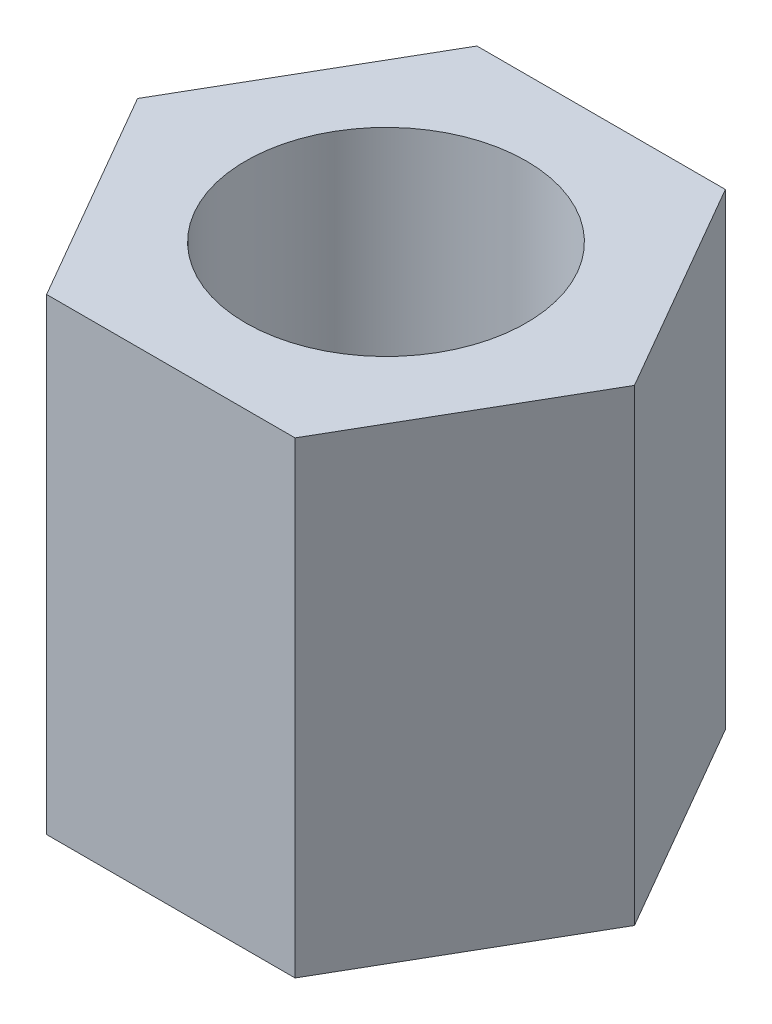
ISO-10303-21;
HEADER;
FILE_DESCRIPTION(('STEP AP214'),'2;1');
FILE_NAME('part.step','',(''),(''),'','','');
FILE_SCHEMA(('AUTOMOTIVE_DESIGN { 1 0 10303 214 1 1 1 1 }'));
ENDSEC;
DATA;
#1=APPLICATION_CONTEXT('core data for automotive mechanical design processes');
#2=APPLICATION_PROTOCOL_DEFINITION('international standard','automotive_design',2000,#1);
#3=PRODUCT_CONTEXT('',#1,'mechanical');
#4=PRODUCT('Part','Part','',(#3));
#5=PRODUCT_RELATED_PRODUCT_CATEGORY('part','',(#4));
#6=PRODUCT_DEFINITION_FORMATION('','',#4);
#7=PRODUCT_DEFINITION_CONTEXT('part definition',#1,'design');
#8=PRODUCT_DEFINITION('design','',#6,#7);
#9=PRODUCT_DEFINITION_SHAPE('','',#8);
#10=(LENGTH_UNIT() NAMED_UNIT(*) SI_UNIT(.MILLI.,.METRE.));
#11=(NAMED_UNIT(*) PLANE_ANGLE_UNIT() SI_UNIT($,.RADIAN.));
#12=(NAMED_UNIT(*) SI_UNIT($,.STERADIAN.) SOLID_ANGLE_UNIT());
#13=UNCERTAINTY_MEASURE_WITH_UNIT(LENGTH_MEASURE(1.E-05),#10,'distance_accuracy_value','');
#14=(GEOMETRIC_REPRESENTATION_CONTEXT(3) GLOBAL_UNCERTAINTY_ASSIGNED_CONTEXT((#13)) GLOBAL_UNIT_ASSIGNED_CONTEXT((#10,
#11,#12)) REPRESENTATION_CONTEXT('',''));
#15=CARTESIAN_POINT('',(0.,0.,0.));
#16=DIRECTION('',(0.,0.,1.));
#17=DIRECTION('',(1.,0.,0.));
#18=AXIS2_PLACEMENT_3D('',#15,#16,#17);
#19=CARTESIAN_POINT('',(-1.99185842870421,5.,1.15));
#20=DIRECTION('',(0.866025403784439,0.,-0.5));
#21=DIRECTION('',(-0.5,0.,-0.866025403784439));
#22=AXIS2_PLACEMENT_3D('',#19,#20,#21);
#23=PLANE('',#22);
#24=DIRECTION('',(0.5,0.,0.866025403784439));
#25=VECTOR('',#24,1.);
#26=CARTESIAN_POINT('',(-1.99185842870421,0.,1.15));
#27=LINE('',#26,#25);
#28=CARTESIAN_POINT('',(-2.65581123827228,0.,0.));
#29=VERTEX_POINT('',#28);
#30=CARTESIAN_POINT('',(-1.32790561913614,0.,2.3));
#31=VERTEX_POINT('',#30);
#32=EDGE_CURVE('E124',#29,#31,#27,.T.);
#33=ORIENTED_EDGE('',*,*,#32,.T.);
#34=DIRECTION('',(0.,-1.,0.));
#35=VECTOR('',#34,1.);
#36=CARTESIAN_POINT('',(-1.32790561913614,5.,2.3));
#37=LINE('',#36,#35);
#38=CARTESIAN_POINT('',(-1.32790561913614,5.,2.3));
#39=VERTEX_POINT('',#38);
#40=EDGE_CURVE('E11',#39,#31,#37,.T.);
#41=ORIENTED_EDGE('',*,*,#40,.F.);
#42=DIRECTION('',(0.5,0.,0.866025403784439));
#43=VECTOR('',#42,1.);
#44=CARTESIAN_POINT('',(-1.99185842870421,5.,1.15));
#45=LINE('',#44,#43);
#46=CARTESIAN_POINT('',(-2.65581123827228,5.,0.));
#47=VERTEX_POINT('',#46);
#48=EDGE_CURVE('E147',#47,#39,#45,.T.);
#49=ORIENTED_EDGE('',*,*,#48,.F.);
#50=DIRECTION('',(0.,-1.,0.));
#51=VECTOR('',#50,1.);
#52=CARTESIAN_POINT('',(-2.65581123827228,5.,0.));
#53=LINE('',#52,#51);
#54=EDGE_CURVE('E117',#47,#29,#53,.T.);
#55=ORIENTED_EDGE('',*,*,#54,.T.);
#56=EDGE_LOOP('',(#33,#41,#49,#55));
#57=FACE_BOUND('',#56,.T.);
#58=ADVANCED_FACE('F36',(#57),#23,.F.);
#59=CARTESIAN_POINT('',(0.,5.,2.3));
#60=DIRECTION('',(0.,0.,-1.));
#61=DIRECTION('',(-1.,0.,0.));
#62=AXIS2_PLACEMENT_3D('',#59,#60,#61);
#63=PLANE('',#62);
#64=DIRECTION('',(1.,0.,0.));
#65=VECTOR('',#64,1.);
#66=CARTESIAN_POINT('',(0.,0.,2.3));
#67=LINE('',#66,#65);
#68=CARTESIAN_POINT('',(1.32790561913614,0.,2.3));
#69=VERTEX_POINT('',#68);
#70=EDGE_CURVE('E127',#31,#69,#67,.T.);
#71=ORIENTED_EDGE('',*,*,#70,.T.);
#72=DIRECTION('',(0.,-1.,0.));
#73=VECTOR('',#72,1.);
#74=CARTESIAN_POINT('',(1.32790561913614,5.,2.3));
#75=LINE('',#74,#73);
#76=CARTESIAN_POINT('',(1.32790561913614,5.,2.3));
#77=VERTEX_POINT('',#76);
#78=EDGE_CURVE('E45',#77,#69,#75,.T.);
#79=ORIENTED_EDGE('',*,*,#78,.F.);
#80=DIRECTION('',(1.,0.,0.));
#81=VECTOR('',#80,1.);
#82=CARTESIAN_POINT('',(0.,5.,2.3));
#83=LINE('',#82,#81);
#84=EDGE_CURVE('E90',#39,#77,#83,.T.);
#85=ORIENTED_EDGE('',*,*,#84,.F.);
#86=ORIENTED_EDGE('',*,*,#40,.T.);
#87=EDGE_LOOP('',(#71,#79,#85,#86));
#88=FACE_BOUND('',#87,.T.);
#89=ADVANCED_FACE('F161',(#88),#63,.F.);
#90=CARTESIAN_POINT('',(1.99185842870421,5.,1.15));
#91=DIRECTION('',(-0.866025403784438,0.,-0.5));
#92=DIRECTION('',(-0.5,0.,0.866025403784438));
#93=AXIS2_PLACEMENT_3D('',#90,#91,#92);
#94=PLANE('',#93);
#95=DIRECTION('',(0.5,0.,-0.866025403784439));
#96=VECTOR('',#95,1.);
#97=CARTESIAN_POINT('',(1.99185842870421,0.,1.15));
#98=LINE('',#97,#96);
#99=CARTESIAN_POINT('',(2.65581123827228,0.,0.));
#100=VERTEX_POINT('',#99);
#101=EDGE_CURVE('E129',#69,#100,#98,.T.);
#102=ORIENTED_EDGE('',*,*,#101,.T.);
#103=DIRECTION('',(0.,-1.,0.));
#104=VECTOR('',#103,1.);
#105=CARTESIAN_POINT('',(2.65581123827228,5.,0.));
#106=LINE('',#105,#104);
#107=CARTESIAN_POINT('',(2.65581123827228,5.,0.));
#108=VERTEX_POINT('',#107);
#109=EDGE_CURVE('E112',#108,#100,#106,.T.);
#110=ORIENTED_EDGE('',*,*,#109,.F.);
#111=DIRECTION('',(0.5,0.,-0.866025403784439));
#112=VECTOR('',#111,1.);
#113=CARTESIAN_POINT('',(1.99185842870421,5.,1.15));
#114=LINE('',#113,#112);
#115=EDGE_CURVE('E103',#77,#108,#114,.T.);
#116=ORIENTED_EDGE('',*,*,#115,.F.);
#117=ORIENTED_EDGE('',*,*,#78,.T.);
#118=EDGE_LOOP('',(#102,#110,#116,#117));
#119=FACE_BOUND('',#118,.T.);
#120=ADVANCED_FACE('F140',(#119),#94,.F.);
#121=CARTESIAN_POINT('',(1.99185842870421,5.,-1.15));
#122=DIRECTION('',(-0.866025403784439,0.,0.5));
#123=DIRECTION('',(0.5,0.,0.866025403784439));
#124=AXIS2_PLACEMENT_3D('',#121,#122,#123);
#125=PLANE('',#124);
#126=DIRECTION('',(-0.5,0.,-0.866025403784439));
#127=VECTOR('',#126,1.);
#128=CARTESIAN_POINT('',(1.99185842870421,0.,-1.15));
#129=LINE('',#128,#127);
#130=CARTESIAN_POINT('',(1.32790561913614,0.,-2.3));
#131=VERTEX_POINT('',#130);
#132=EDGE_CURVE('E111',#100,#131,#129,.T.);
#133=ORIENTED_EDGE('',*,*,#132,.T.);
#134=DIRECTION('',(0.,-1.,0.));
#135=VECTOR('',#134,1.);
#136=CARTESIAN_POINT('',(1.32790561913614,5.,-2.3));
#137=LINE('',#136,#135);
#138=CARTESIAN_POINT('',(1.32790561913614,5.,-2.3));
#139=VERTEX_POINT('',#138);
#140=EDGE_CURVE('E108',#139,#131,#137,.T.);
#141=ORIENTED_EDGE('',*,*,#140,.F.);
#142=DIRECTION('',(-0.5,0.,-0.866025403784439));
#143=VECTOR('',#142,1.);
#144=CARTESIAN_POINT('',(1.99185842870421,5.,-1.15));
#145=LINE('',#144,#143);
#146=EDGE_CURVE('E97',#108,#139,#145,.T.);
#147=ORIENTED_EDGE('',*,*,#146,.F.);
#148=ORIENTED_EDGE('',*,*,#109,.T.);
#149=EDGE_LOOP('',(#133,#141,#147,#148));
#150=FACE_BOUND('',#149,.T.);
#151=ADVANCED_FACE('F109',(#150),#125,.F.);
#152=CARTESIAN_POINT('',(0.,5.,-2.3));
#153=DIRECTION('',(0.,0.,1.));
#154=DIRECTION('',(1.,0.,0.));
#155=AXIS2_PLACEMENT_3D('',#152,#153,#154);
#156=PLANE('',#155);
#157=DIRECTION('',(-1.,0.,0.));
#158=VECTOR('',#157,1.);
#159=CARTESIAN_POINT('',(0.,0.,-2.3));
#160=LINE('',#159,#158);
#161=CARTESIAN_POINT('',(-1.32790561913614,0.,-2.3));
#162=VERTEX_POINT('',#161);
#163=EDGE_CURVE('E76',#131,#162,#160,.T.);
#164=ORIENTED_EDGE('',*,*,#163,.T.);
#165=DIRECTION('',(0.,-1.,0.));
#166=VECTOR('',#165,1.);
#167=CARTESIAN_POINT('',(-1.32790561913614,5.,-2.3));
#168=LINE('',#167,#166);
#169=CARTESIAN_POINT('',(-1.32790561913614,5.,-2.3));
#170=VERTEX_POINT('',#169);
#171=EDGE_CURVE('E113',#170,#162,#168,.T.);
#172=ORIENTED_EDGE('',*,*,#171,.F.);
#173=DIRECTION('',(-1.,0.,0.));
#174=VECTOR('',#173,1.);
#175=CARTESIAN_POINT('',(0.,5.,-2.3));
#176=LINE('',#175,#174);
#177=EDGE_CURVE('E101',#139,#170,#176,.T.);
#178=ORIENTED_EDGE('',*,*,#177,.F.);
#179=ORIENTED_EDGE('',*,*,#140,.T.);
#180=EDGE_LOOP('',(#164,#172,#178,#179));
#181=FACE_BOUND('',#180,.T.);
#182=ADVANCED_FACE('F115',(#181),#156,.F.);
#183=CARTESIAN_POINT('',(0.,5.,0.));
#184=DIRECTION('',(0.,-1.,0.));
#185=DIRECTION('',(0.,0.,-1.));
#186=AXIS2_PLACEMENT_3D('',#183,#184,#185);
#187=CYLINDRICAL_SURFACE('',#186,1.5);
#188=CARTESIAN_POINT('',(0.,5.,0.));
#189=DIRECTION('',(0.,1.,0.));
#190=DIRECTION('',(0.,0.,1.));
#191=AXIS2_PLACEMENT_3D('',#188,#189,#190);
#192=CIRCLE('',#191,1.5);
#193=CARTESIAN_POINT('',(0.,5.,1.5));
#194=VERTEX_POINT('',#193);
#195=EDGE_CURVE('E134',#194,#194,#192,.T.);
#196=ORIENTED_EDGE('',*,*,#195,.T.);
#197=EDGE_LOOP('',(#196));
#198=FACE_BOUND('',#197,.T.);
#199=CARTESIAN_POINT('',(0.,0.,0.));
#200=DIRECTION('',(0.,1.,0.));
#201=DIRECTION('',(0.,0.,1.));
#202=AXIS2_PLACEMENT_3D('',#199,#200,#201);
#203=CIRCLE('',#202,1.5);
#204=CARTESIAN_POINT('',(0.,0.,1.5));
#205=VERTEX_POINT('',#204);
#206=EDGE_CURVE('E121',#205,#205,#203,.T.);
#207=ORIENTED_EDGE('',*,*,#206,.F.);
#208=EDGE_LOOP('',(#207));
#209=FACE_BOUND('',#208,.T.);
#210=ADVANCED_FACE('F38',(#198,#209),#187,.F.);
#211=CARTESIAN_POINT('',(-1.99185842870421,5.,-1.15));
#212=DIRECTION('',(0.866025403784439,0.,0.5));
#213=DIRECTION('',(0.5,0.,-0.866025403784439));
#214=AXIS2_PLACEMENT_3D('',#211,#212,#213);
#215=PLANE('',#214);
#216=DIRECTION('',(-0.5,0.,0.866025403784439));
#217=VECTOR('',#216,1.);
#218=CARTESIAN_POINT('',(-1.99185842870421,0.,-1.15));
#219=LINE('',#218,#217);
#220=EDGE_CURVE('E82',#162,#29,#219,.T.);
#221=ORIENTED_EDGE('',*,*,#220,.T.);
#222=ORIENTED_EDGE('',*,*,#54,.F.);
#223=DIRECTION('',(-0.5,0.,0.866025403784439));
#224=VECTOR('',#223,1.);
#225=CARTESIAN_POINT('',(-1.99185842870421,5.,-1.15));
#226=LINE('',#225,#224);
#227=EDGE_CURVE('E53',#170,#47,#226,.T.);
#228=ORIENTED_EDGE('',*,*,#227,.F.);
#229=ORIENTED_EDGE('',*,*,#171,.T.);
#230=EDGE_LOOP('',(#221,#222,#228,#229));
#231=FACE_BOUND('',#230,.T.);
#232=ADVANCED_FACE('F148',(#231),#215,.F.);
#233=CARTESIAN_POINT('',(0.,5.,0.));
#234=DIRECTION('',(0.,1.,0.));
#235=DIRECTION('',(0.,0.,1.));
#236=AXIS2_PLACEMENT_3D('',#233,#234,#235);
#237=PLANE('',#236);
#238=ORIENTED_EDGE('',*,*,#195,.F.);
#239=EDGE_LOOP('',(#238));
#240=FACE_BOUND('',#239,.T.);
#241=ORIENTED_EDGE('',*,*,#48,.T.);
#242=ORIENTED_EDGE('',*,*,#84,.T.);
#243=ORIENTED_EDGE('',*,*,#115,.T.);
#244=ORIENTED_EDGE('',*,*,#146,.T.);
#245=ORIENTED_EDGE('',*,*,#177,.T.);
#246=ORIENTED_EDGE('',*,*,#227,.T.);
#247=EDGE_LOOP('',(#241,#242,#243,#244,#245,#246));
#248=FACE_BOUND('',#247,.T.);
#249=ADVANCED_FACE('F99',(#240,#248),#237,.T.);
#250=CARTESIAN_POINT('',(0.,0.,0.));
#251=DIRECTION('',(0.,1.,0.));
#252=DIRECTION('',(0.,0.,1.));
#253=AXIS2_PLACEMENT_3D('',#250,#251,#252);
#254=PLANE('',#253);
#255=ORIENTED_EDGE('',*,*,#206,.T.);
#256=EDGE_LOOP('',(#255));
#257=FACE_BOUND('',#256,.T.);
#258=ORIENTED_EDGE('',*,*,#32,.F.);
#259=ORIENTED_EDGE('',*,*,#220,.F.);
#260=ORIENTED_EDGE('',*,*,#163,.F.);
#261=ORIENTED_EDGE('',*,*,#132,.F.);
#262=ORIENTED_EDGE('',*,*,#101,.F.);
#263=ORIENTED_EDGE('',*,*,#70,.F.);
#264=EDGE_LOOP('',(#258,#259,#260,#261,#262,#263));
#265=FACE_BOUND('',#264,.T.);
#266=ADVANCED_FACE('F143',(#257,#265),#254,.F.);
#267=CLOSED_SHELL('',(#58,#89,#120,#151,#182,#210,#232,#249,#266));
#268=MANIFOLD_SOLID_BREP('B2',#267);
#269=ADVANCED_BREP_SHAPE_REPRESENTATION('',(#18,#268),#14);
#270=SHAPE_DEFINITION_REPRESENTATION(#9,#269);
ENDSEC;
END-ISO-10303-21;
